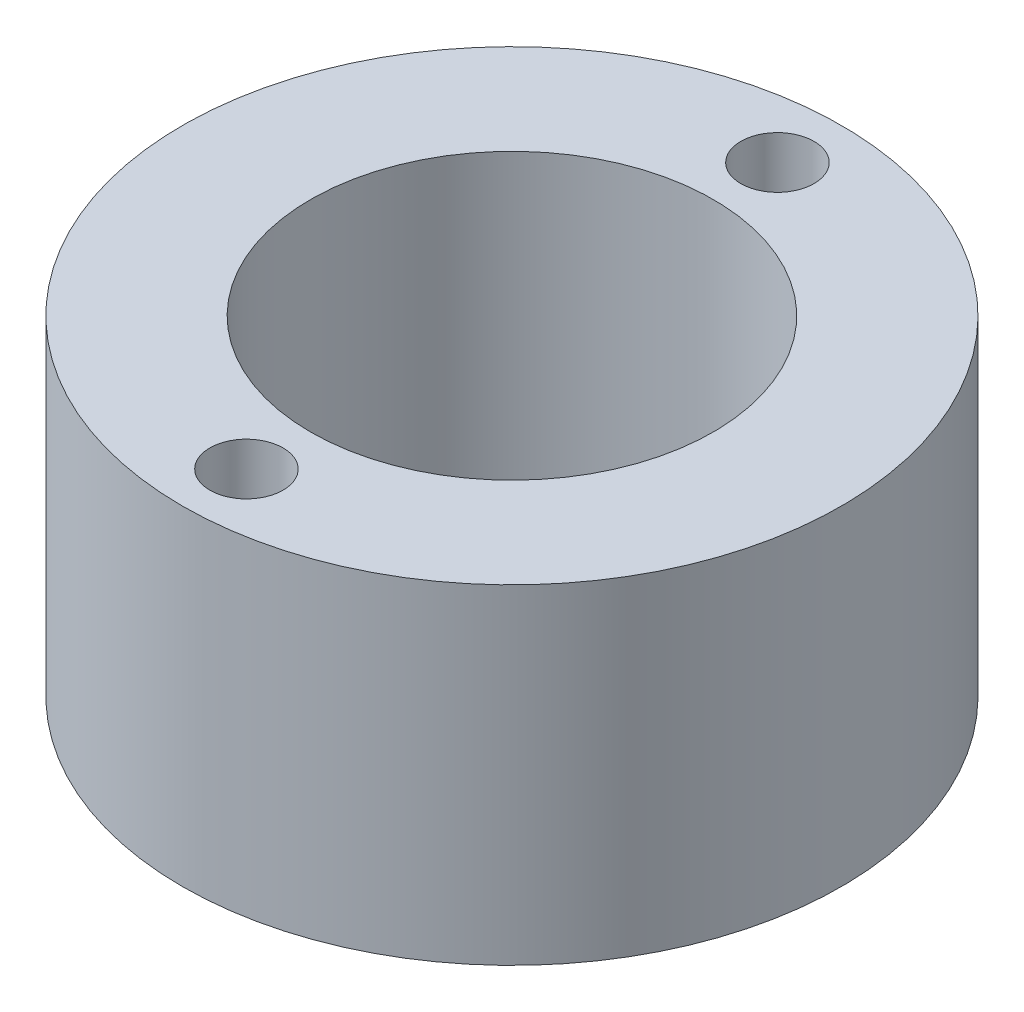
ISO-10303-21;
HEADER;
FILE_DESCRIPTION(('STEP AP214'),'2;1');
FILE_NAME('part.step','',(''),(''),'','','');
FILE_SCHEMA(('AUTOMOTIVE_DESIGN { 1 0 10303 214 1 1 1 1 }'));
ENDSEC;
DATA;
#1=APPLICATION_CONTEXT('core data for automotive mechanical design processes');
#2=APPLICATION_PROTOCOL_DEFINITION('international standard','automotive_design',2000,#1);
#3=PRODUCT_CONTEXT('',#1,'mechanical');
#4=PRODUCT('Part','Part','',(#3));
#5=PRODUCT_RELATED_PRODUCT_CATEGORY('part','',(#4));
#6=PRODUCT_DEFINITION_FORMATION('','',#4);
#7=PRODUCT_DEFINITION_CONTEXT('part definition',#1,'design');
#8=PRODUCT_DEFINITION('design','',#6,#7);
#9=PRODUCT_DEFINITION_SHAPE('','',#8);
#10=(LENGTH_UNIT() NAMED_UNIT(*) SI_UNIT(.MILLI.,.METRE.));
#11=(NAMED_UNIT(*) PLANE_ANGLE_UNIT() SI_UNIT($,.RADIAN.));
#12=(NAMED_UNIT(*) SI_UNIT($,.STERADIAN.) SOLID_ANGLE_UNIT());
#13=UNCERTAINTY_MEASURE_WITH_UNIT(LENGTH_MEASURE(1.E-05),#10,'distance_accuracy_value','');
#14=(GEOMETRIC_REPRESENTATION_CONTEXT(3) GLOBAL_UNCERTAINTY_ASSIGNED_CONTEXT((#13)) GLOBAL_UNIT_ASSIGNED_CONTEXT((#10,
#11,#12)) REPRESENTATION_CONTEXT('',''));
#15=CARTESIAN_POINT('',(0.,0.,0.));
#16=DIRECTION('',(0.,0.,1.));
#17=DIRECTION('',(1.,0.,0.));
#18=AXIS2_PLACEMENT_3D('',#15,#16,#17);
#19=CARTESIAN_POINT('',(0.,9.,0.));
#20=DIRECTION('',(0.,-1.,0.));
#21=DIRECTION('',(0.,0.,-1.));
#22=AXIS2_PLACEMENT_3D('',#19,#20,#21);
#23=CYLINDRICAL_SURFACE('',#22,9.);
#24=CARTESIAN_POINT('',(0.,9.,0.));
#25=DIRECTION('',(0.,1.,0.));
#26=DIRECTION('',(0.,0.,1.));
#27=AXIS2_PLACEMENT_3D('',#24,#25,#26);
#28=CIRCLE('',#27,9.);
#29=CARTESIAN_POINT('',(0.,9.,9.));
#30=VERTEX_POINT('',#29);
#31=EDGE_CURVE('E10',#30,#30,#28,.T.);
#32=ORIENTED_EDGE('',*,*,#31,.F.);
#33=EDGE_LOOP('',(#32));
#34=FACE_BOUND('',#33,.T.);
#35=CARTESIAN_POINT('',(0.,0.,0.));
#36=DIRECTION('',(0.,1.,0.));
#37=DIRECTION('',(0.,0.,1.));
#38=AXIS2_PLACEMENT_3D('',#35,#36,#37);
#39=CIRCLE('',#38,9.);
#40=CARTESIAN_POINT('',(0.,0.,9.));
#41=VERTEX_POINT('',#40);
#42=EDGE_CURVE('E44',#41,#41,#39,.T.);
#43=ORIENTED_EDGE('',*,*,#42,.T.);
#44=EDGE_LOOP('',(#43));
#45=FACE_BOUND('',#44,.T.);
#46=ADVANCED_FACE('F41',(#34,#45),#23,.T.);
#47=CARTESIAN_POINT('',(0.,9.,0.));
#48=DIRECTION('',(0.,1.,0.));
#49=DIRECTION('',(0.,0.,1.));
#50=AXIS2_PLACEMENT_3D('',#47,#48,#49);
#51=PLANE('',#50);
#52=CARTESIAN_POINT('',(0.,9.,-7.25));
#53=DIRECTION('',(0.,1.,0.));
#54=DIRECTION('',(0.,0.,1.));
#55=AXIS2_PLACEMENT_3D('',#52,#53,#54);
#56=CIRCLE('',#55,1.);
#57=CARTESIAN_POINT('',(0.,9.,-6.25));
#58=VERTEX_POINT('',#57);
#59=EDGE_CURVE('E71',#58,#58,#56,.T.);
#60=ORIENTED_EDGE('',*,*,#59,.F.);
#61=EDGE_LOOP('',(#60));
#62=FACE_BOUND('',#61,.T.);
#63=CARTESIAN_POINT('',(0.,9.,7.25));
#64=DIRECTION('',(0.,1.,0.));
#65=DIRECTION('',(0.,0.,-1.));
#66=AXIS2_PLACEMENT_3D('',#63,#64,#65);
#67=CIRCLE('',#66,0.999999999999999);
#68=CARTESIAN_POINT('',(0.,9.,6.25));
#69=VERTEX_POINT('',#68);
#70=EDGE_CURVE('E67',#69,#69,#67,.T.);
#71=ORIENTED_EDGE('',*,*,#70,.F.);
#72=EDGE_LOOP('',(#71));
#73=FACE_BOUND('',#72,.T.);
#74=CARTESIAN_POINT('',(0.,9.,0.));
#75=DIRECTION('',(0.,1.,0.));
#76=DIRECTION('',(0.,0.,1.));
#77=AXIS2_PLACEMENT_3D('',#74,#75,#76);
#78=CIRCLE('',#77,5.5);
#79=CARTESIAN_POINT('',(0.,9.,5.5));
#80=VERTEX_POINT('',#79);
#81=EDGE_CURVE('E55',#80,#80,#78,.T.);
#82=ORIENTED_EDGE('',*,*,#81,.F.);
#83=EDGE_LOOP('',(#82));
#84=FACE_BOUND('',#83,.T.);
#85=ORIENTED_EDGE('',*,*,#31,.T.);
#86=EDGE_LOOP('',(#85));
#87=FACE_BOUND('',#86,.T.);
#88=ADVANCED_FACE('F88',(#62,#73,#84,#87),#51,.T.);
#89=CARTESIAN_POINT('',(0.,0.,0.));
#90=DIRECTION('',(0.,1.,0.));
#91=DIRECTION('',(0.,0.,1.));
#92=AXIS2_PLACEMENT_3D('',#89,#90,#91);
#93=PLANE('',#92);
#94=ORIENTED_EDGE('',*,*,#42,.F.);
#95=EDGE_LOOP('',(#94));
#96=FACE_BOUND('',#95,.T.);
#97=ADVANCED_FACE('F91',(#96),#93,.F.);
#98=CARTESIAN_POINT('',(0.,0.999999999999999,0.));
#99=DIRECTION('',(0.,1.,0.));
#100=DIRECTION('',(0.,0.,1.));
#101=AXIS2_PLACEMENT_3D('',#98,#99,#100);
#102=CYLINDRICAL_SURFACE('',#101,5.5);
#103=CARTESIAN_POINT('',(0.,0.999999999999999,0.));
#104=DIRECTION('',(0.,1.,0.));
#105=DIRECTION('',(0.,0.,1.));
#106=AXIS2_PLACEMENT_3D('',#103,#104,#105);
#107=CIRCLE('',#106,5.5);
#108=CARTESIAN_POINT('',(0.,0.999999999999999,5.5));
#109=VERTEX_POINT('',#108);
#110=EDGE_CURVE('E53',#109,#109,#107,.T.);
#111=ORIENTED_EDGE('',*,*,#110,.F.);
#112=EDGE_LOOP('',(#111));
#113=FACE_BOUND('',#112,.T.);
#114=ORIENTED_EDGE('',*,*,#81,.T.);
#115=EDGE_LOOP('',(#114));
#116=FACE_BOUND('',#115,.T.);
#117=ADVANCED_FACE('F97',(#113,#116),#102,.F.);
#118=CARTESIAN_POINT('',(0.,0.999999999999999,0.));
#119=DIRECTION('',(0.,1.,0.));
#120=DIRECTION('',(0.,0.,1.));
#121=AXIS2_PLACEMENT_3D('',#118,#119,#120);
#122=PLANE('',#121);
#123=ORIENTED_EDGE('',*,*,#110,.T.);
#124=EDGE_LOOP('',(#123));
#125=FACE_BOUND('',#124,.T.);
#126=ADVANCED_FACE('F99',(#125),#122,.T.);
#127=CARTESIAN_POINT('',(0.,6.,7.25));
#128=DIRECTION('',(0.,1.,0.));
#129=DIRECTION('',(0.,0.,1.));
#130=AXIS2_PLACEMENT_3D('',#127,#128,#129);
#131=CYLINDRICAL_SURFACE('',#130,0.999999999999999);
#132=CARTESIAN_POINT('',(0.,6.,7.25));
#133=DIRECTION('',(0.,1.,0.));
#134=DIRECTION('',(0.,0.,-1.));
#135=AXIS2_PLACEMENT_3D('',#132,#133,#134);
#136=CIRCLE('',#135,0.999999999999999);
#137=CARTESIAN_POINT('',(0.,6.,6.25));
#138=VERTEX_POINT('',#137);
#139=EDGE_CURVE('E63',#138,#138,#136,.T.);
#140=ORIENTED_EDGE('',*,*,#139,.F.);
#141=EDGE_LOOP('',(#140));
#142=FACE_BOUND('',#141,.T.);
#143=ORIENTED_EDGE('',*,*,#70,.T.);
#144=EDGE_LOOP('',(#143));
#145=FACE_BOUND('',#144,.T.);
#146=ADVANCED_FACE('F106',(#142,#145),#131,.F.);
#147=CARTESIAN_POINT('',(0.,6.,7.25));
#148=DIRECTION('',(0.,-1.,0.));
#149=DIRECTION('',(0.,0.,-1.));
#150=AXIS2_PLACEMENT_3D('',#147,#148,#149);
#151=PLANE('',#150);
#152=ORIENTED_EDGE('',*,*,#139,.T.);
#153=EDGE_LOOP('',(#152));
#154=FACE_BOUND('',#153,.T.);
#155=ADVANCED_FACE('F84',(#154),#151,.F.);
#156=CARTESIAN_POINT('',(0.,6.,-7.25));
#157=DIRECTION('',(0.,1.,0.));
#158=DIRECTION('',(0.,0.,1.));
#159=AXIS2_PLACEMENT_3D('',#156,#157,#158);
#160=CYLINDRICAL_SURFACE('',#159,1.);
#161=CARTESIAN_POINT('',(0.,6.,-7.25));
#162=DIRECTION('',(0.,1.,0.));
#163=DIRECTION('',(0.,0.,1.));
#164=AXIS2_PLACEMENT_3D('',#161,#162,#163);
#165=CIRCLE('',#164,1.);
#166=CARTESIAN_POINT('',(0.,6.,-6.25));
#167=VERTEX_POINT('',#166);
#168=EDGE_CURVE('E59',#167,#167,#165,.T.);
#169=ORIENTED_EDGE('',*,*,#168,.F.);
#170=EDGE_LOOP('',(#169));
#171=FACE_BOUND('',#170,.T.);
#172=ORIENTED_EDGE('',*,*,#59,.T.);
#173=EDGE_LOOP('',(#172));
#174=FACE_BOUND('',#173,.T.);
#175=ADVANCED_FACE('F81',(#171,#174),#160,.F.);
#176=CARTESIAN_POINT('',(0.,6.,-7.25));
#177=DIRECTION('',(0.,1.,0.));
#178=DIRECTION('',(0.,0.,1.));
#179=AXIS2_PLACEMENT_3D('',#176,#177,#178);
#180=PLANE('',#179);
#181=ORIENTED_EDGE('',*,*,#168,.T.);
#182=EDGE_LOOP('',(#181));
#183=FACE_BOUND('',#182,.T.);
#184=ADVANCED_FACE('F79',(#183),#180,.T.);
#185=CLOSED_SHELL('',(#46,#88,#97,#117,#126,#146,#155,#175,#184));
#186=MANIFOLD_SOLID_BREP('B2',#185);
#187=ADVANCED_BREP_SHAPE_REPRESENTATION('',(#18,#186),#14);
#188=SHAPE_DEFINITION_REPRESENTATION(#9,#187);
ENDSEC;
END-ISO-10303-21;
